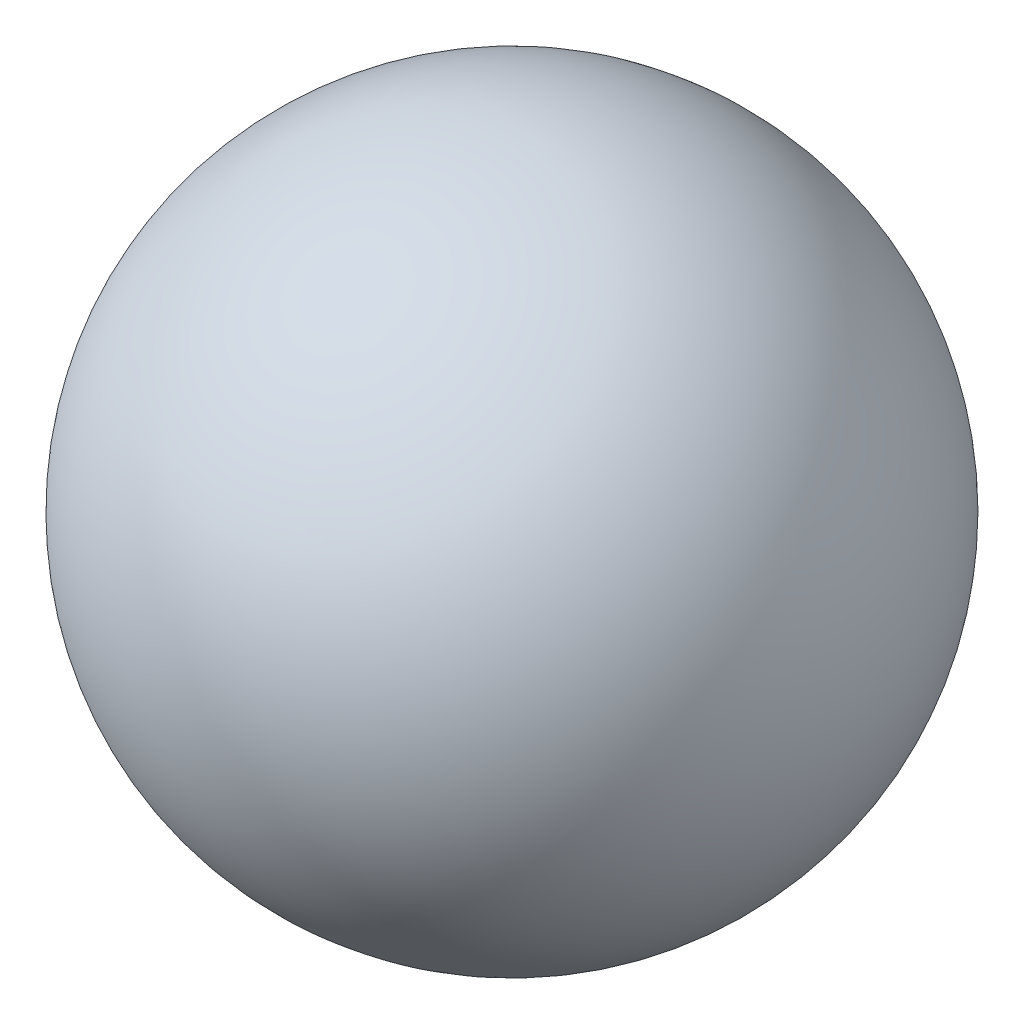
ISO-10303-21;
HEADER;
FILE_DESCRIPTION(('STEP AP214'),'2;1');
FILE_NAME('part.step','',(''),(''),'','','');
FILE_SCHEMA(('AUTOMOTIVE_DESIGN { 1 0 10303 214 1 1 1 1 }'));
ENDSEC;
DATA;
#1=APPLICATION_CONTEXT('core data for automotive mechanical design processes');
#2=APPLICATION_PROTOCOL_DEFINITION('international standard','automotive_design',2000,#1);
#3=PRODUCT_CONTEXT('',#1,'mechanical');
#4=PRODUCT('Part','Part','',(#3));
#5=PRODUCT_RELATED_PRODUCT_CATEGORY('part','',(#4));
#6=PRODUCT_DEFINITION_FORMATION('','',#4);
#7=PRODUCT_DEFINITION_CONTEXT('part definition',#1,'design');
#8=PRODUCT_DEFINITION('design','',#6,#7);
#9=PRODUCT_DEFINITION_SHAPE('','',#8);
#10=(LENGTH_UNIT() NAMED_UNIT(*) SI_UNIT(.MILLI.,.METRE.));
#11=(NAMED_UNIT(*) PLANE_ANGLE_UNIT() SI_UNIT($,.RADIAN.));
#12=(NAMED_UNIT(*) SI_UNIT($,.STERADIAN.) SOLID_ANGLE_UNIT());
#13=UNCERTAINTY_MEASURE_WITH_UNIT(LENGTH_MEASURE(1.E-05),#10,'distance_accuracy_value','');
#14=(GEOMETRIC_REPRESENTATION_CONTEXT(3) GLOBAL_UNCERTAINTY_ASSIGNED_CONTEXT((#13)) GLOBAL_UNIT_ASSIGNED_CONTEXT((#10,
#11,#12)) REPRESENTATION_CONTEXT('',''));
#15=CARTESIAN_POINT('',(0.,0.,0.));
#16=DIRECTION('',(0.,0.,1.));
#17=DIRECTION('',(1.,0.,0.));
#18=AXIS2_PLACEMENT_3D('',#15,#16,#17);
#19=CARTESIAN_POINT('',(64.16,61.8803514678704,-31.3818863552375));
#20=DIRECTION('',(0.,0.891866184337219,-0.452299357987368));
#21=DIRECTION('',(0.173648177666934,0.445427914428401,0.878316732984701));
#22=AXIS2_PLACEMENT_3D('',#19,#20,#21);
#23=SPHERICAL_SURFACE('',#22,7.15);
#24=CARTESIAN_POINT('',(64.16,55.5035082498593,-28.1479459456278));
#25=VERTEX_POINT('',#24);
#26=VERTEX_LOOP('',#25);
#27=FACE_BOUND('',#26,.T.);
#28=CARTESIAN_POINT('',(64.16,68.2571946858814,-34.6158267648473));
#29=VERTEX_POINT('',#28);
#30=VERTEX_LOOP('',#29);
#31=FACE_BOUND('',#30,.T.);
#32=ADVANCED_FACE('F23',(#27,#31),#23,.T.);
#33=CLOSED_SHELL('',(#32));
#34=MANIFOLD_SOLID_BREP('B1',#33);
#35=ADVANCED_BREP_SHAPE_REPRESENTATION('',(#18,#34),#14);
#36=SHAPE_DEFINITION_REPRESENTATION(#9,#35);
ENDSEC;
END-ISO-10303-21;
